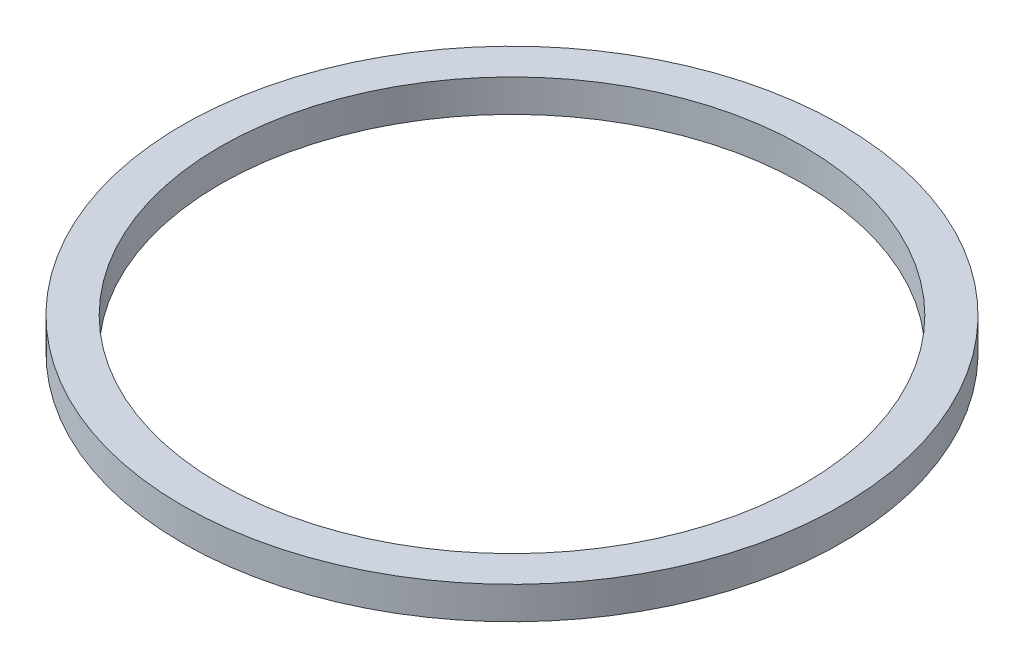
ISO-10303-21;
HEADER;
FILE_DESCRIPTION(('STEP AP214'),'2;1');
FILE_NAME('part.step','',(''),(''),'','','');
FILE_SCHEMA(('AUTOMOTIVE_DESIGN { 1 0 10303 214 1 1 1 1 }'));
ENDSEC;
DATA;
#1=APPLICATION_CONTEXT('core data for automotive mechanical design processes');
#2=APPLICATION_PROTOCOL_DEFINITION('international standard','automotive_design',2000,#1);
#3=PRODUCT_CONTEXT('',#1,'mechanical');
#4=PRODUCT('Part','Part','',(#3));
#5=PRODUCT_RELATED_PRODUCT_CATEGORY('part','',(#4));
#6=PRODUCT_DEFINITION_FORMATION('','',#4);
#7=PRODUCT_DEFINITION_CONTEXT('part definition',#1,'design');
#8=PRODUCT_DEFINITION('design','',#6,#7);
#9=PRODUCT_DEFINITION_SHAPE('','',#8);
#10=(LENGTH_UNIT() NAMED_UNIT(*) SI_UNIT(.MILLI.,.METRE.));
#11=(NAMED_UNIT(*) PLANE_ANGLE_UNIT() SI_UNIT($,.RADIAN.));
#12=(NAMED_UNIT(*) SI_UNIT($,.STERADIAN.) SOLID_ANGLE_UNIT());
#13=UNCERTAINTY_MEASURE_WITH_UNIT(LENGTH_MEASURE(1.E-05),#10,'distance_accuracy_value','');
#14=(GEOMETRIC_REPRESENTATION_CONTEXT(3) GLOBAL_UNCERTAINTY_ASSIGNED_CONTEXT((#13)) GLOBAL_UNIT_ASSIGNED_CONTEXT((#10,
#11,#12)) REPRESENTATION_CONTEXT('',''));
#15=CARTESIAN_POINT('',(0.,0.,0.));
#16=DIRECTION('',(0.,0.,1.));
#17=DIRECTION('',(1.,0.,0.));
#18=AXIS2_PLACEMENT_3D('',#15,#16,#17);
#19=CARTESIAN_POINT('',(22.5,0.,0.));
#20=DIRECTION('',(0.,1.,0.));
#21=DIRECTION('',(0.,0.,1.));
#22=AXIS2_PLACEMENT_3D('',#19,#20,#21);
#23=PLANE('',#22);
#24=CARTESIAN_POINT('',(0.,0.,0.));
#25=DIRECTION('',(0.,1.,0.));
#26=DIRECTION('',(0.,0.,1.));
#27=AXIS2_PLACEMENT_3D('',#24,#25,#26);
#28=CIRCLE('',#27,25.4);
#29=CARTESIAN_POINT('',(0.,0.,25.4));
#30=VERTEX_POINT('',#29);
#31=EDGE_CURVE('E10',#30,#30,#28,.T.);
#32=ORIENTED_EDGE('',*,*,#31,.F.);
#33=EDGE_LOOP('',(#32));
#34=FACE_BOUND('',#33,.T.);
#35=CARTESIAN_POINT('',(0.,0.,0.));
#36=DIRECTION('',(0.,1.,0.));
#37=DIRECTION('',(0.,0.,1.));
#38=AXIS2_PLACEMENT_3D('',#35,#36,#37);
#39=CIRCLE('',#38,22.5);
#40=CARTESIAN_POINT('',(0.,0.,22.5));
#41=VERTEX_POINT('',#40);
#42=EDGE_CURVE('E51',#41,#41,#39,.T.);
#43=ORIENTED_EDGE('',*,*,#42,.T.);
#44=EDGE_LOOP('',(#43));
#45=FACE_BOUND('',#44,.T.);
#46=ADVANCED_FACE('F37',(#34,#45),#23,.F.);
#47=CARTESIAN_POINT('',(0.,77.1441422656178,0.));
#48=DIRECTION('',(0.,1.,0.));
#49=DIRECTION('',(0.,0.,1.));
#50=AXIS2_PLACEMENT_3D('',#47,#48,#49);
#51=CYLINDRICAL_SURFACE('',#50,25.4);
#52=CARTESIAN_POINT('',(0.,2.5,0.));
#53=DIRECTION('',(0.,1.,0.));
#54=DIRECTION('',(0.,0.,1.));
#55=AXIS2_PLACEMENT_3D('',#52,#53,#54);
#56=CIRCLE('',#55,25.4);
#57=CARTESIAN_POINT('',(0.,2.5,25.4));
#58=VERTEX_POINT('',#57);
#59=EDGE_CURVE('E43',#58,#58,#56,.T.);
#60=ORIENTED_EDGE('',*,*,#59,.F.);
#61=EDGE_LOOP('',(#60));
#62=FACE_BOUND('',#61,.T.);
#63=ORIENTED_EDGE('',*,*,#31,.T.);
#64=EDGE_LOOP('',(#63));
#65=FACE_BOUND('',#64,.T.);
#66=ADVANCED_FACE('F66',(#62,#65),#51,.T.);
#67=CARTESIAN_POINT('',(22.5,2.5,0.));
#68=DIRECTION('',(0.,-1.,0.));
#69=DIRECTION('',(0.,0.,-1.));
#70=AXIS2_PLACEMENT_3D('',#67,#68,#69);
#71=PLANE('',#70);
#72=CARTESIAN_POINT('',(0.,2.5,0.));
#73=DIRECTION('',(0.,1.,0.));
#74=DIRECTION('',(0.,0.,1.));
#75=AXIS2_PLACEMENT_3D('',#72,#73,#74);
#76=CIRCLE('',#75,22.5);
#77=CARTESIAN_POINT('',(0.,2.5,22.5));
#78=VERTEX_POINT('',#77);
#79=EDGE_CURVE('E47',#78,#78,#76,.T.);
#80=ORIENTED_EDGE('',*,*,#79,.F.);
#81=EDGE_LOOP('',(#80));
#82=FACE_BOUND('',#81,.T.);
#83=ORIENTED_EDGE('',*,*,#59,.T.);
#84=EDGE_LOOP('',(#83));
#85=FACE_BOUND('',#84,.T.);
#86=ADVANCED_FACE('F61',(#82,#85),#71,.F.);
#87=CARTESIAN_POINT('',(0.,77.1441422656178,0.));
#88=DIRECTION('',(0.,1.,0.));
#89=DIRECTION('',(0.,0.,1.));
#90=AXIS2_PLACEMENT_3D('',#87,#88,#89);
#91=CYLINDRICAL_SURFACE('',#90,22.5);
#92=ORIENTED_EDGE('',*,*,#42,.F.);
#93=EDGE_LOOP('',(#92));
#94=FACE_BOUND('',#93,.T.);
#95=ORIENTED_EDGE('',*,*,#79,.T.);
#96=EDGE_LOOP('',(#95));
#97=FACE_BOUND('',#96,.T.);
#98=ADVANCED_FACE('F58',(#94,#97),#91,.F.);
#99=CLOSED_SHELL('',(#46,#66,#86,#98));
#100=MANIFOLD_SOLID_BREP('B2',#99);
#101=ADVANCED_BREP_SHAPE_REPRESENTATION('',(#18,#100),#14);
#102=SHAPE_DEFINITION_REPRESENTATION(#9,#101);
ENDSEC;
END-ISO-10303-21;
